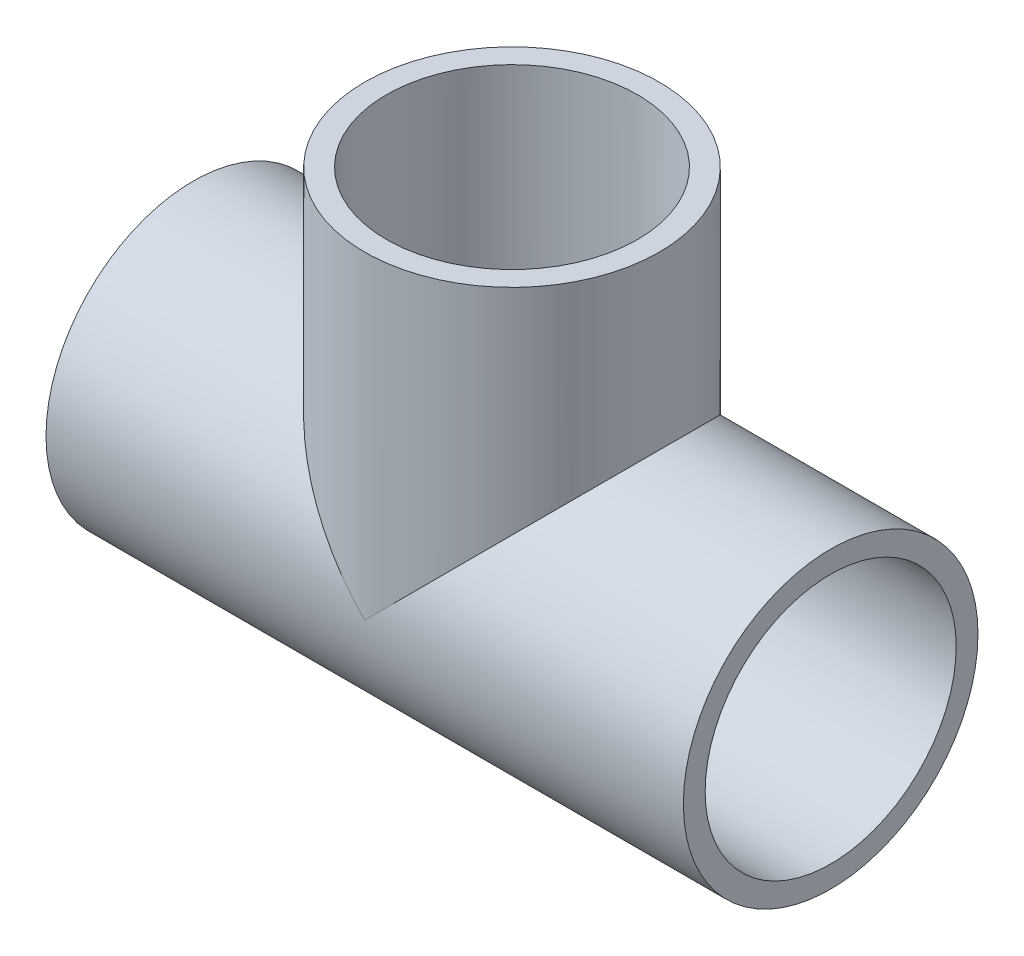
ISO-10303-21;
HEADER;
FILE_DESCRIPTION(('STEP AP214'),'2;1');
FILE_NAME('part.step','',(''),(''),'','','');
FILE_SCHEMA(('AUTOMOTIVE_DESIGN { 1 0 10303 214 1 1 1 1 }'));
ENDSEC;
DATA;
#1=APPLICATION_CONTEXT('core data for automotive mechanical design processes');
#2=APPLICATION_PROTOCOL_DEFINITION('international standard','automotive_design',2000,#1);
#3=PRODUCT_CONTEXT('',#1,'mechanical');
#4=PRODUCT('Part','Part','',(#3));
#5=PRODUCT_RELATED_PRODUCT_CATEGORY('part','',(#4));
#6=PRODUCT_DEFINITION_FORMATION('','',#4);
#7=PRODUCT_DEFINITION_CONTEXT('part definition',#1,'design');
#8=PRODUCT_DEFINITION('design','',#6,#7);
#9=PRODUCT_DEFINITION_SHAPE('','',#8);
#10=(LENGTH_UNIT() NAMED_UNIT(*) SI_UNIT(.MILLI.,.METRE.));
#11=(NAMED_UNIT(*) PLANE_ANGLE_UNIT() SI_UNIT($,.RADIAN.));
#12=(NAMED_UNIT(*) SI_UNIT($,.STERADIAN.) SOLID_ANGLE_UNIT());
#13=UNCERTAINTY_MEASURE_WITH_UNIT(LENGTH_MEASURE(1.E-05),#10,'distance_accuracy_value','');
#14=(GEOMETRIC_REPRESENTATION_CONTEXT(3) GLOBAL_UNCERTAINTY_ASSIGNED_CONTEXT((#13)) GLOBAL_UNIT_ASSIGNED_CONTEXT((#10,
#11,#12)) REPRESENTATION_CONTEXT('',''));
#15=CARTESIAN_POINT('',(0.,0.,0.));
#16=DIRECTION('',(0.,0.,1.));
#17=DIRECTION('',(1.,0.,0.));
#18=AXIS2_PLACEMENT_3D('',#15,#16,#17);
#19=CARTESIAN_POINT('',(-22.225,0.,0.));
#20=DIRECTION('',(1.,0.,0.));
#21=DIRECTION('',(0.,0.,-1.));
#22=AXIS2_PLACEMENT_3D('',#19,#20,#21);
#23=PLANE('',#22);
#24=CARTESIAN_POINT('',(-22.225,0.,0.));
#25=DIRECTION('',(-1.,0.,0.));
#26=DIRECTION('',(0.,0.,1.));
#27=AXIS2_PLACEMENT_3D('',#24,#25,#26);
#28=CIRCLE('',#27,21.0185);
#29=CARTESIAN_POINT('',(-22.225,0.,21.0185));
#30=VERTEX_POINT('',#29);
#31=EDGE_CURVE('E86',#30,#30,#28,.T.);
#32=ORIENTED_EDGE('',*,*,#31,.T.);
#33=EDGE_LOOP('',(#32));
#34=FACE_BOUND('',#33,.T.);
#35=CARTESIAN_POINT('',(-22.225,0.,0.));
#36=DIRECTION('',(1.,0.,0.));
#37=DIRECTION('',(0.,0.,-1.));
#38=AXIS2_PLACEMENT_3D('',#35,#36,#37);
#39=CIRCLE('',#38,17.526);
#40=CARTESIAN_POINT('',(-22.225,0.,-17.526));
#41=VERTEX_POINT('',#40);
#42=EDGE_CURVE('E69',#41,#41,#39,.T.);
#43=ORIENTED_EDGE('',*,*,#42,.T.);
#44=EDGE_LOOP('',(#43));
#45=FACE_BOUND('',#44,.T.);
#46=ADVANCED_FACE('F30',(#34,#45),#23,.F.);
#47=CARTESIAN_POINT('',(22.225,0.,0.));
#48=DIRECTION('',(1.,0.,0.));
#49=DIRECTION('',(0.,0.,-1.));
#50=AXIS2_PLACEMENT_3D('',#47,#48,#49);
#51=PLANE('',#50);
#52=CARTESIAN_POINT('',(22.225,0.,0.));
#53=DIRECTION('',(1.,0.,0.));
#54=DIRECTION('',(0.,0.,-1.));
#55=AXIS2_PLACEMENT_3D('',#52,#53,#54);
#56=CIRCLE('',#55,17.526);
#57=CARTESIAN_POINT('',(22.225,0.,-17.526));
#58=VERTEX_POINT('',#57);
#59=EDGE_CURVE('E66',#58,#58,#56,.T.);
#60=ORIENTED_EDGE('',*,*,#59,.F.);
#61=EDGE_LOOP('',(#60));
#62=FACE_BOUND('',#61,.T.);
#63=CARTESIAN_POINT('',(22.225,0.,0.));
#64=DIRECTION('',(1.,0.,0.));
#65=DIRECTION('',(0.,0.,-1.));
#66=AXIS2_PLACEMENT_3D('',#63,#64,#65);
#67=CIRCLE('',#66,21.0185);
#68=CARTESIAN_POINT('',(22.225,0.,-21.0185));
#69=VERTEX_POINT('',#68);
#70=EDGE_CURVE('E57',#69,#69,#67,.F.);
#71=ORIENTED_EDGE('',*,*,#70,.F.);
#72=EDGE_LOOP('',(#71));
#73=FACE_BOUND('',#72,.T.);
#74=ADVANCED_FACE('F108',(#62,#73),#51,.T.);
#75=CARTESIAN_POINT('',(22.225,0.,0.));
#76=DIRECTION('',(-1.,0.,0.));
#77=DIRECTION('',(0.,0.,1.));
#78=AXIS2_PLACEMENT_3D('',#75,#76,#77);
#79=CYLINDRICAL_SURFACE('',#78,24.892);
#80=CARTESIAN_POINT('',(-53.848,0.,0.));
#81=DIRECTION('',(-1.,0.,0.));
#82=DIRECTION('',(0.,0.,1.));
#83=AXIS2_PLACEMENT_3D('',#80,#81,#82);
#84=CIRCLE('',#83,24.892);
#85=CARTESIAN_POINT('',(-53.848,0.,24.892));
#86=VERTEX_POINT('',#85);
#87=EDGE_CURVE('E83',#86,#86,#84,.T.);
#88=ORIENTED_EDGE('',*,*,#87,.F.);
#89=EDGE_LOOP('',(#88));
#90=FACE_BOUND('',#89,.T.);
#91=CARTESIAN_POINT('',(53.848,0.,0.));
#92=DIRECTION('',(-1.,0.,0.));
#93=DIRECTION('',(0.,0.,1.));
#94=AXIS2_PLACEMENT_3D('',#91,#92,#93);
#95=CIRCLE('',#94,24.892);
#96=CARTESIAN_POINT('',(53.848,0.,24.892));
#97=VERTEX_POINT('',#96);
#98=EDGE_CURVE('E71',#97,#97,#95,.T.);
#99=ORIENTED_EDGE('',*,*,#98,.T.);
#100=EDGE_LOOP('',(#99));
#101=FACE_BOUND('',#100,.T.);
#102=CARTESIAN_POINT('',(0.,0.,0.));
#103=DIRECTION('',(-0.707106781186547,-0.707106781186547,0.));
#104=DIRECTION('',(0.707106781186547,-0.707106781186547,0.));
#105=AXIS2_PLACEMENT_3D('',#102,#103,#104);
#106=ELLIPSE('',#105,35.2026039945911,24.892);
#107=CARTESIAN_POINT('',(0.,0.,24.892));
#108=VERTEX_POINT('',#107);
#109=CARTESIAN_POINT('',(0.,0.,-24.892));
#110=VERTEX_POINT('',#109);
#111=EDGE_CURVE('E92',#108,#110,#106,.T.);
#112=ORIENTED_EDGE('',*,*,#111,.T.);
#113=CARTESIAN_POINT('',(0.,0.,0.));
#114=DIRECTION('',(0.707106781186547,-0.707106781186547,0.));
#115=DIRECTION('',(-0.707106781186547,-0.707106781186547,0.));
#116=AXIS2_PLACEMENT_3D('',#113,#114,#115);
#117=ELLIPSE('',#116,35.2026039945911,24.892);
#118=EDGE_CURVE('E49',#110,#108,#117,.T.);
#119=ORIENTED_EDGE('',*,*,#118,.T.);
#120=EDGE_LOOP('',(#112,#119));
#121=FACE_BOUND('',#120,.T.);
#122=ADVANCED_FACE('F110',(#90,#101,#121),#79,.T.);
#123=CARTESIAN_POINT('',(-22.225,0.,0.));
#124=DIRECTION('',(-1.,0.,0.));
#125=DIRECTION('',(0.,0.,1.));
#126=AXIS2_PLACEMENT_3D('',#123,#124,#125);
#127=CONICAL_SURFACE('',#126,21.0185,0.00602402351617044);
#128=CARTESIAN_POINT('',(-53.848,0.,0.));
#129=DIRECTION('',(-1.,0.,0.));
#130=DIRECTION('',(0.,0.,1.));
#131=AXIS2_PLACEMENT_3D('',#128,#129,#130);
#132=CIRCLE('',#131,21.209);
#133=CARTESIAN_POINT('',(-53.848,0.,21.209));
#134=VERTEX_POINT('',#133);
#135=EDGE_CURVE('E89',#134,#134,#132,.T.);
#136=ORIENTED_EDGE('',*,*,#135,.T.);
#137=EDGE_LOOP('',(#136));
#138=FACE_BOUND('',#137,.T.);
#139=ORIENTED_EDGE('',*,*,#31,.F.);
#140=EDGE_LOOP('',(#139));
#141=FACE_BOUND('',#140,.T.);
#142=ADVANCED_FACE('F117',(#138,#141),#127,.F.);
#143=CARTESIAN_POINT('',(53.848,0.,0.));
#144=DIRECTION('',(1.,0.,0.));
#145=DIRECTION('',(0.,0.,-1.));
#146=AXIS2_PLACEMENT_3D('',#143,#144,#145);
#147=CONICAL_SURFACE('',#146,21.209,0.00602402351617022);
#148=CARTESIAN_POINT('',(53.848,0.,0.));
#149=DIRECTION('',(-1.,0.,0.));
#150=DIRECTION('',(0.,0.,1.));
#151=AXIS2_PLACEMENT_3D('',#148,#149,#150);
#152=CIRCLE('',#151,21.209);
#153=CARTESIAN_POINT('',(53.848,0.,21.209));
#154=VERTEX_POINT('',#153);
#155=EDGE_CURVE('E74',#154,#154,#152,.T.);
#156=ORIENTED_EDGE('',*,*,#155,.F.);
#157=EDGE_LOOP('',(#156));
#158=FACE_BOUND('',#157,.T.);
#159=ORIENTED_EDGE('',*,*,#70,.T.);
#160=EDGE_LOOP('',(#159));
#161=FACE_BOUND('',#160,.T.);
#162=ADVANCED_FACE('F106',(#158,#161),#147,.F.);
#163=CARTESIAN_POINT('',(0.,53.848,0.));
#164=DIRECTION('',(0.,1.,0.));
#165=DIRECTION('',(-1.,0.,0.));
#166=AXIS2_PLACEMENT_3D('',#163,#164,#165);
#167=CONICAL_SURFACE('',#166,21.209,0.00602402351617044);
#168=CARTESIAN_POINT('',(0.,53.848,0.));
#169=DIRECTION('',(0.,-1.,0.));
#170=DIRECTION('',(1.,0.,0.));
#171=AXIS2_PLACEMENT_3D('',#168,#169,#170);
#172=CIRCLE('',#171,21.209);
#173=CARTESIAN_POINT('',(21.209,53.848,0.));
#174=VERTEX_POINT('',#173);
#175=EDGE_CURVE('E94',#174,#174,#172,.T.);
#176=ORIENTED_EDGE('',*,*,#175,.F.);
#177=EDGE_LOOP('',(#176));
#178=FACE_BOUND('',#177,.T.);
#179=CARTESIAN_POINT('',(0.,22.225,0.));
#180=DIRECTION('',(0.,-1.,0.));
#181=DIRECTION('',(1.,0.,0.));
#182=AXIS2_PLACEMENT_3D('',#179,#180,#181);
#183=CIRCLE('',#182,21.0185);
#184=CARTESIAN_POINT('',(21.0185,22.225,0.));
#185=VERTEX_POINT('',#184);
#186=EDGE_CURVE('E97',#185,#185,#183,.T.);
#187=ORIENTED_EDGE('',*,*,#186,.T.);
#188=EDGE_LOOP('',(#187));
#189=FACE_BOUND('',#188,.T.);
#190=ADVANCED_FACE('F126',(#178,#189),#167,.F.);
#191=CARTESIAN_POINT('',(24.892,53.848,0.));
#192=DIRECTION('',(0.,1.,0.));
#193=DIRECTION('',(-1.,0.,0.));
#194=AXIS2_PLACEMENT_3D('',#191,#192,#193);
#195=PLANE('',#194);
#196=ORIENTED_EDGE('',*,*,#175,.T.);
#197=EDGE_LOOP('',(#196));
#198=FACE_BOUND('',#197,.T.);
#199=CARTESIAN_POINT('',(0.,53.848,0.));
#200=DIRECTION('',(0.,-1.,0.));
#201=DIRECTION('',(1.,0.,0.));
#202=AXIS2_PLACEMENT_3D('',#199,#200,#201);
#203=CIRCLE('',#202,24.892);
#204=CARTESIAN_POINT('',(24.892,53.848,0.));
#205=VERTEX_POINT('',#204);
#206=EDGE_CURVE('E100',#205,#205,#203,.T.);
#207=ORIENTED_EDGE('',*,*,#206,.F.);
#208=EDGE_LOOP('',(#207));
#209=FACE_BOUND('',#208,.T.);
#210=ADVANCED_FACE('F32',(#198,#209),#195,.T.);
#211=CARTESIAN_POINT('',(0.,0.,0.));
#212=DIRECTION('',(0.,-1.,0.));
#213=DIRECTION('',(1.,0.,0.));
#214=AXIS2_PLACEMENT_3D('',#211,#212,#213);
#215=CYLINDRICAL_SURFACE('',#214,24.892);
#216=ORIENTED_EDGE('',*,*,#118,.F.);
#217=ORIENTED_EDGE('',*,*,#111,.F.);
#218=EDGE_LOOP('',(#216,#217));
#219=FACE_BOUND('',#218,.T.);
#220=ORIENTED_EDGE('',*,*,#206,.T.);
#221=EDGE_LOOP('',(#220));
#222=FACE_BOUND('',#221,.T.);
#223=ADVANCED_FACE('F129',(#219,#222),#215,.T.);
#224=CARTESIAN_POINT('',(-53.848,-24.892,0.));
#225=DIRECTION('',(-1.,0.,0.));
#226=DIRECTION('',(0.,0.,1.));
#227=AXIS2_PLACEMENT_3D('',#224,#225,#226);
#228=PLANE('',#227);
#229=ORIENTED_EDGE('',*,*,#87,.T.);
#230=EDGE_LOOP('',(#229));
#231=FACE_BOUND('',#230,.T.);
#232=ORIENTED_EDGE('',*,*,#135,.F.);
#233=EDGE_LOOP('',(#232));
#234=FACE_BOUND('',#233,.T.);
#235=ADVANCED_FACE('F123',(#231,#234),#228,.T.);
#236=CARTESIAN_POINT('',(53.848,-24.892,0.));
#237=DIRECTION('',(1.,0.,0.));
#238=DIRECTION('',(0.,0.,-1.));
#239=AXIS2_PLACEMENT_3D('',#236,#237,#238);
#240=PLANE('',#239);
#241=ORIENTED_EDGE('',*,*,#155,.T.);
#242=EDGE_LOOP('',(#241));
#243=FACE_BOUND('',#242,.T.);
#244=ORIENTED_EDGE('',*,*,#98,.F.);
#245=EDGE_LOOP('',(#244));
#246=FACE_BOUND('',#245,.T.);
#247=ADVANCED_FACE('F135',(#243,#246),#240,.T.);
#248=CARTESIAN_POINT('',(0.,22.225,0.));
#249=DIRECTION('',(0.,-1.,0.));
#250=DIRECTION('',(1.,0.,0.));
#251=AXIS2_PLACEMENT_3D('',#248,#249,#250);
#252=PLANE('',#251);
#253=CARTESIAN_POINT('',(0.,22.225,0.));
#254=DIRECTION('',(0.,-1.,0.));
#255=DIRECTION('',(0.,0.,-1.));
#256=AXIS2_PLACEMENT_3D('',#253,#254,#255);
#257=CIRCLE('',#256,17.526);
#258=CARTESIAN_POINT('',(0.,22.225,-17.526));
#259=VERTEX_POINT('',#258);
#260=EDGE_CURVE('E76',#259,#259,#257,.T.);
#261=ORIENTED_EDGE('',*,*,#260,.T.);
#262=EDGE_LOOP('',(#261));
#263=FACE_BOUND('',#262,.T.);
#264=ORIENTED_EDGE('',*,*,#186,.F.);
#265=EDGE_LOOP('',(#264));
#266=FACE_BOUND('',#265,.T.);
#267=ADVANCED_FACE('F61',(#263,#266),#252,.F.);
#268=CARTESIAN_POINT('',(53.848,0.,0.));
#269=DIRECTION('',(1.,0.,0.));
#270=DIRECTION('',(0.,0.,-1.));
#271=AXIS2_PLACEMENT_3D('',#268,#269,#270);
#272=CYLINDRICAL_SURFACE('',#271,17.526);
#273=CARTESIAN_POINT('',(0.,0.,0.));
#274=DIRECTION('',(0.707106781186547,-0.707106781186547,0.));
#275=DIRECTION('',(0.707106781186547,0.707106781186547,0.));
#276=AXIS2_PLACEMENT_3D('',#273,#274,#275);
#277=ELLIPSE('',#276,24.7855068941509,17.526);
#278=CARTESIAN_POINT('',(0.,0.,-17.526));
#279=VERTEX_POINT('',#278);
#280=CARTESIAN_POINT('',(0.,0.,17.526));
#281=VERTEX_POINT('',#280);
#282=EDGE_CURVE('E11',#279,#281,#277,.T.);
#283=ORIENTED_EDGE('',*,*,#282,.F.);
#284=CARTESIAN_POINT('',(0.,0.,0.));
#285=DIRECTION('',(0.707106781186547,0.707106781186547,0.));
#286=DIRECTION('',(0.707106781186547,-0.707106781186547,0.));
#287=AXIS2_PLACEMENT_3D('',#284,#285,#286);
#288=ELLIPSE('',#287,24.7855068941509,17.526);
#289=EDGE_CURVE('E38',#281,#279,#288,.F.);
#290=ORIENTED_EDGE('',*,*,#289,.F.);
#291=EDGE_LOOP('',(#283,#290));
#292=FACE_BOUND('',#291,.T.);
#293=ORIENTED_EDGE('',*,*,#59,.T.);
#294=EDGE_LOOP('',(#293));
#295=FACE_BOUND('',#294,.T.);
#296=ORIENTED_EDGE('',*,*,#42,.F.);
#297=EDGE_LOOP('',(#296));
#298=FACE_BOUND('',#297,.T.);
#299=ADVANCED_FACE('F58',(#292,#295,#298),#272,.F.);
#300=CARTESIAN_POINT('',(0.,0.,0.));
#301=DIRECTION('',(0.,-1.,0.));
#302=DIRECTION('',(0.,0.,-1.));
#303=AXIS2_PLACEMENT_3D('',#300,#301,#302);
#304=CYLINDRICAL_SURFACE('',#303,17.526);
#305=ORIENTED_EDGE('',*,*,#282,.T.);
#306=ORIENTED_EDGE('',*,*,#289,.T.);
#307=EDGE_LOOP('',(#305,#306));
#308=FACE_BOUND('',#307,.T.);
#309=ORIENTED_EDGE('',*,*,#260,.F.);
#310=EDGE_LOOP('',(#309));
#311=FACE_BOUND('',#310,.T.);
#312=ADVANCED_FACE('F54',(#308,#311),#304,.F.);
#313=CLOSED_SHELL('',(#46,#74,#122,#142,#162,#190,#210,#223,#235,#247,#267,#299,#312));
#314=MANIFOLD_SOLID_BREP('B2',#313);
#315=ADVANCED_BREP_SHAPE_REPRESENTATION('',(#18,#314),#14);
#316=SHAPE_DEFINITION_REPRESENTATION(#9,#315);
ENDSEC;
END-ISO-10303-21;
